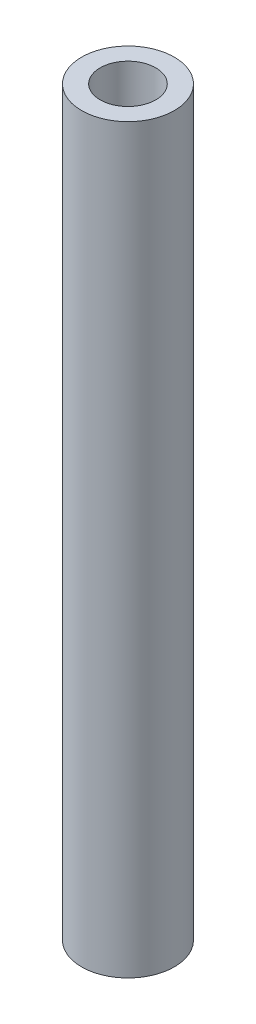
ISO-10303-21;
HEADER;
FILE_DESCRIPTION(('STEP AP214'),'2;1');
FILE_NAME('part.step','',(''),(''),'','','');
FILE_SCHEMA(('AUTOMOTIVE_DESIGN { 1 0 10303 214 1 1 1 1 }'));
ENDSEC;
DATA;
#1=APPLICATION_CONTEXT('core data for automotive mechanical design processes');
#2=APPLICATION_PROTOCOL_DEFINITION('international standard','automotive_design',2000,#1);
#3=PRODUCT_CONTEXT('',#1,'mechanical');
#4=PRODUCT('Part','Part','',(#3));
#5=PRODUCT_RELATED_PRODUCT_CATEGORY('part','',(#4));
#6=PRODUCT_DEFINITION_FORMATION('','',#4);
#7=PRODUCT_DEFINITION_CONTEXT('part definition',#1,'design');
#8=PRODUCT_DEFINITION('design','',#6,#7);
#9=PRODUCT_DEFINITION_SHAPE('','',#8);
#10=(LENGTH_UNIT() NAMED_UNIT(*) SI_UNIT(.MILLI.,.METRE.));
#11=(NAMED_UNIT(*) PLANE_ANGLE_UNIT() SI_UNIT($,.RADIAN.));
#12=(NAMED_UNIT(*) SI_UNIT($,.STERADIAN.) SOLID_ANGLE_UNIT());
#13=UNCERTAINTY_MEASURE_WITH_UNIT(LENGTH_MEASURE(1.E-05),#10,'distance_accuracy_value','');
#14=(GEOMETRIC_REPRESENTATION_CONTEXT(3) GLOBAL_UNCERTAINTY_ASSIGNED_CONTEXT((#13)) GLOBAL_UNIT_ASSIGNED_CONTEXT((#10,
#11,#12)) REPRESENTATION_CONTEXT('',''));
#15=CARTESIAN_POINT('',(0.,0.,0.));
#16=DIRECTION('',(0.,0.,1.));
#17=DIRECTION('',(1.,0.,0.));
#18=AXIS2_PLACEMENT_3D('',#15,#16,#17);
#19=CARTESIAN_POINT('',(0.,40.,0.));
#20=DIRECTION('',(0.,1.,0.));
#21=DIRECTION('',(0.,0.,1.));
#22=AXIS2_PLACEMENT_3D('',#19,#20,#21);
#23=PLANE('',#22);
#24=CARTESIAN_POINT('',(0.,40.,0.));
#25=DIRECTION('',(0.,1.,0.));
#26=DIRECTION('',(0.,0.,1.));
#27=AXIS2_PLACEMENT_3D('',#24,#25,#26);
#28=CIRCLE('',#27,2.5);
#29=CARTESIAN_POINT('',(0.,40.,2.5));
#30=VERTEX_POINT('',#29);
#31=EDGE_CURVE('E10',#30,#30,#28,.T.);
#32=ORIENTED_EDGE('',*,*,#31,.T.);
#33=EDGE_LOOP('',(#32));
#34=FACE_BOUND('',#33,.T.);
#35=CARTESIAN_POINT('',(0.,40.,0.));
#36=DIRECTION('',(0.,1.,0.));
#37=DIRECTION('',(0.,0.,1.));
#38=AXIS2_PLACEMENT_3D('',#35,#36,#37);
#39=CIRCLE('',#38,1.5);
#40=CARTESIAN_POINT('',(0.,40.,1.5));
#41=VERTEX_POINT('',#40);
#42=EDGE_CURVE('E51',#41,#41,#39,.T.);
#43=ORIENTED_EDGE('',*,*,#42,.F.);
#44=EDGE_LOOP('',(#43));
#45=FACE_BOUND('',#44,.T.);
#46=ADVANCED_FACE('F38',(#34,#45),#23,.T.);
#47=CARTESIAN_POINT('',(0.,0.,0.));
#48=DIRECTION('',(0.,1.,0.));
#49=DIRECTION('',(0.,0.,1.));
#50=AXIS2_PLACEMENT_3D('',#47,#48,#49);
#51=PLANE('',#50);
#52=CARTESIAN_POINT('',(0.,0.,0.));
#53=DIRECTION('',(0.,1.,0.));
#54=DIRECTION('',(0.,0.,1.));
#55=AXIS2_PLACEMENT_3D('',#52,#53,#54);
#56=CIRCLE('',#55,2.5);
#57=CARTESIAN_POINT('',(0.,0.,2.5));
#58=VERTEX_POINT('',#57);
#59=EDGE_CURVE('E42',#58,#58,#56,.T.);
#60=ORIENTED_EDGE('',*,*,#59,.F.);
#61=EDGE_LOOP('',(#60));
#62=FACE_BOUND('',#61,.T.);
#63=CARTESIAN_POINT('',(0.,0.,0.));
#64=DIRECTION('',(0.,1.,0.));
#65=DIRECTION('',(0.,0.,1.));
#66=AXIS2_PLACEMENT_3D('',#63,#64,#65);
#67=CIRCLE('',#66,1.5);
#68=CARTESIAN_POINT('',(0.,0.,1.5));
#69=VERTEX_POINT('',#68);
#70=EDGE_CURVE('E53',#69,#69,#67,.T.);
#71=ORIENTED_EDGE('',*,*,#70,.T.);
#72=EDGE_LOOP('',(#71));
#73=FACE_BOUND('',#72,.T.);
#74=ADVANCED_FACE('F65',(#62,#73),#51,.F.);
#75=CARTESIAN_POINT('',(0.,40.,0.));
#76=DIRECTION('',(0.,-1.,0.));
#77=DIRECTION('',(0.,0.,-1.));
#78=AXIS2_PLACEMENT_3D('',#75,#76,#77);
#79=CYLINDRICAL_SURFACE('',#78,2.5);
#80=ORIENTED_EDGE('',*,*,#31,.F.);
#81=EDGE_LOOP('',(#80));
#82=FACE_BOUND('',#81,.T.);
#83=ORIENTED_EDGE('',*,*,#59,.T.);
#84=EDGE_LOOP('',(#83));
#85=FACE_BOUND('',#84,.T.);
#86=ADVANCED_FACE('F40',(#82,#85),#79,.T.);
#87=CARTESIAN_POINT('',(0.,40.,0.));
#88=DIRECTION('',(0.,-1.,0.));
#89=DIRECTION('',(0.,0.,-1.));
#90=AXIS2_PLACEMENT_3D('',#87,#88,#89);
#91=CYLINDRICAL_SURFACE('',#90,1.5);
#92=ORIENTED_EDGE('',*,*,#42,.T.);
#93=EDGE_LOOP('',(#92));
#94=FACE_BOUND('',#93,.T.);
#95=ORIENTED_EDGE('',*,*,#70,.F.);
#96=EDGE_LOOP('',(#95));
#97=FACE_BOUND('',#96,.T.);
#98=ADVANCED_FACE('F61',(#94,#97),#91,.F.);
#99=CLOSED_SHELL('',(#46,#74,#86,#98));
#100=MANIFOLD_SOLID_BREP('B2',#99);
#101=ADVANCED_BREP_SHAPE_REPRESENTATION('',(#18,#100),#14);
#102=SHAPE_DEFINITION_REPRESENTATION(#9,#101);
ENDSEC;
END-ISO-10303-21;
